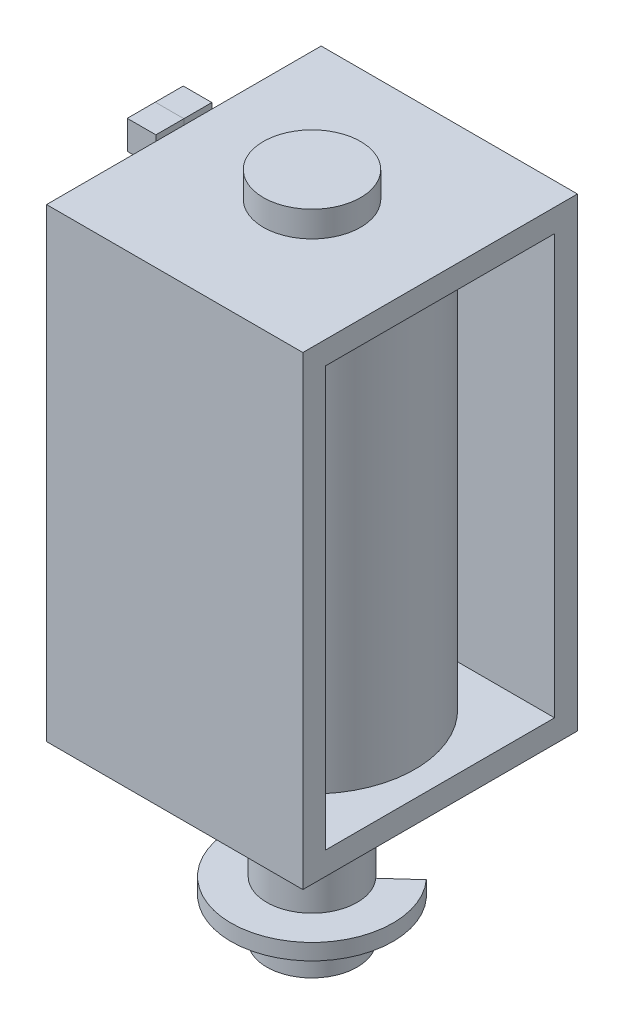
ISO-10303-21;
HEADER;
FILE_DESCRIPTION(('STEP AP214'),'2;1');
FILE_NAME('part.step','',(''),(''),'','','');
FILE_SCHEMA(('AUTOMOTIVE_DESIGN { 1 0 10303 214 1 1 1 1 }'));
ENDSEC;
DATA;
#1=APPLICATION_CONTEXT('core data for automotive mechanical design processes');
#2=APPLICATION_PROTOCOL_DEFINITION('international standard','automotive_design',2000,#1);
#3=PRODUCT_CONTEXT('',#1,'mechanical');
#4=PRODUCT('Part','Part','',(#3));
#5=PRODUCT_RELATED_PRODUCT_CATEGORY('part','',(#4));
#6=PRODUCT_DEFINITION_FORMATION('','',#4);
#7=PRODUCT_DEFINITION_CONTEXT('part definition',#1,'design');
#8=PRODUCT_DEFINITION('design','',#6,#7);
#9=PRODUCT_DEFINITION_SHAPE('','',#8);
#10=(LENGTH_UNIT() NAMED_UNIT(*) SI_UNIT(.MILLI.,.METRE.));
#11=(NAMED_UNIT(*) PLANE_ANGLE_UNIT() SI_UNIT($,.RADIAN.));
#12=(NAMED_UNIT(*) SI_UNIT($,.STERADIAN.) SOLID_ANGLE_UNIT());
#13=UNCERTAINTY_MEASURE_WITH_UNIT(LENGTH_MEASURE(1.E-05),#10,'distance_accuracy_value','');
#14=(GEOMETRIC_REPRESENTATION_CONTEXT(3) GLOBAL_UNCERTAINTY_ASSIGNED_CONTEXT((#13)) GLOBAL_UNIT_ASSIGNED_CONTEXT((#10,
#11,#12)) REPRESENTATION_CONTEXT('',''));
#15=CARTESIAN_POINT('',(0.,0.,0.));
#16=DIRECTION('',(0.,0.,1.));
#17=DIRECTION('',(1.,0.,0.));
#18=AXIS2_PLACEMENT_3D('',#15,#16,#17);
#19=CARTESIAN_POINT('',(-6.9596,0.,1.24287012850082));
#20=DIRECTION('',(0.,0.,1.));
#21=DIRECTION('',(1.,0.,0.));
#22=AXIS2_PLACEMENT_3D('',#19,#20,#21);
#23=PLANE('',#22);
#24=DIRECTION('',(0.,-1.,0.));
#25=VECTOR('',#24,1.);
#26=CARTESIAN_POINT('',(-5.6896,0.,1.24287012850082));
#27=LINE('',#26,#25);
#28=CARTESIAN_POINT('',(-5.6896,10.5791,1.24287012850082));
#29=VERTEX_POINT('',#28);
#30=CARTESIAN_POINT('',(-5.6896,9.3091,1.24287012850082));
#31=VERTEX_POINT('',#30);
#32=EDGE_CURVE('E115',#29,#31,#27,.T.);
#33=ORIENTED_EDGE('',*,*,#32,.F.);
#34=DIRECTION('',(1.,0.,0.));
#35=VECTOR('',#34,1.);
#36=CARTESIAN_POINT('',(-6.9596,10.5791,1.24287012850082));
#37=LINE('',#36,#35);
#38=CARTESIAN_POINT('',(-6.9596,10.5791,1.24287012850082));
#39=VERTEX_POINT('',#38);
#40=EDGE_CURVE('E12',#39,#29,#37,.T.);
#41=ORIENTED_EDGE('',*,*,#40,.F.);
#42=DIRECTION('',(0.,-1.,0.));
#43=VECTOR('',#42,1.);
#44=CARTESIAN_POINT('',(-6.9596,0.,1.24287012850082));
#45=LINE('',#44,#43);
#46=CARTESIAN_POINT('',(-6.9596,9.3091,1.24287012850082));
#47=VERTEX_POINT('',#46);
#48=EDGE_CURVE('E108',#39,#47,#45,.T.);
#49=ORIENTED_EDGE('',*,*,#48,.T.);
#50=DIRECTION('',(1.,0.,0.));
#51=VECTOR('',#50,1.);
#52=CARTESIAN_POINT('',(-6.9596,9.3091,1.24287012850082));
#53=LINE('',#52,#51);
#54=EDGE_CURVE('E90',#47,#31,#53,.T.);
#55=ORIENTED_EDGE('',*,*,#54,.T.);
#56=EDGE_LOOP('',(#33,#41,#49,#55));
#57=FACE_BOUND('',#56,.T.);
#58=ADVANCED_FACE('F52',(#57),#23,.T.);
#59=CARTESIAN_POINT('',(-6.9596,10.5791,0.));
#60=DIRECTION('',(0.,1.,0.));
#61=DIRECTION('',(0.,0.,1.));
#62=AXIS2_PLACEMENT_3D('',#59,#60,#61);
#63=PLANE('',#62);
#64=DIRECTION('',(0.,0.,1.));
#65=VECTOR('',#64,1.);
#66=CARTESIAN_POINT('',(-5.6896,10.5791,0.));
#67=LINE('',#66,#65);
#68=CARTESIAN_POINT('',(-5.6896,10.5791,0.));
#69=VERTEX_POINT('',#68);
#70=EDGE_CURVE('E101',#69,#29,#67,.T.);
#71=ORIENTED_EDGE('',*,*,#70,.F.);
#72=DIRECTION('',(1.,0.,0.));
#73=VECTOR('',#72,1.);
#74=CARTESIAN_POINT('',(-6.9596,10.5791,0.));
#75=LINE('',#74,#73);
#76=CARTESIAN_POINT('',(-6.9596,10.5791,0.));
#77=VERTEX_POINT('',#76);
#78=EDGE_CURVE('E60',#77,#69,#75,.T.);
#79=ORIENTED_EDGE('',*,*,#78,.F.);
#80=DIRECTION('',(0.,0.,1.));
#81=VECTOR('',#80,1.);
#82=CARTESIAN_POINT('',(-6.9596,10.5791,0.));
#83=LINE('',#82,#81);
#84=EDGE_CURVE('E99',#77,#39,#83,.T.);
#85=ORIENTED_EDGE('',*,*,#84,.T.);
#86=ORIENTED_EDGE('',*,*,#40,.T.);
#87=EDGE_LOOP('',(#71,#79,#85,#86));
#88=FACE_BOUND('',#87,.T.);
#89=ADVANCED_FACE('F98',(#88),#63,.T.);
#90=CARTESIAN_POINT('',(-6.9596,0.,0.));
#91=DIRECTION('',(0.,0.,-1.));
#92=DIRECTION('',(-1.,0.,0.));
#93=AXIS2_PLACEMENT_3D('',#90,#91,#92);
#94=PLANE('',#93);
#95=DIRECTION('',(0.,1.,0.));
#96=VECTOR('',#95,1.);
#97=CARTESIAN_POINT('',(-5.6896,0.,0.));
#98=LINE('',#97,#96);
#99=CARTESIAN_POINT('',(-5.6896,9.3091,0.));
#100=VERTEX_POINT('',#99);
#101=EDGE_CURVE('E119',#100,#69,#98,.T.);
#102=ORIENTED_EDGE('',*,*,#101,.F.);
#103=DIRECTION('',(1.,0.,0.));
#104=VECTOR('',#103,1.);
#105=CARTESIAN_POINT('',(-6.9596,9.3091,0.));
#106=LINE('',#105,#104);
#107=CARTESIAN_POINT('',(-6.9596,9.3091,0.));
#108=VERTEX_POINT('',#107);
#109=EDGE_CURVE('E83',#108,#100,#106,.T.);
#110=ORIENTED_EDGE('',*,*,#109,.F.);
#111=DIRECTION('',(0.,1.,0.));
#112=VECTOR('',#111,1.);
#113=CARTESIAN_POINT('',(-6.9596,0.,0.));
#114=LINE('',#113,#112);
#115=EDGE_CURVE('E107',#108,#77,#114,.T.);
#116=ORIENTED_EDGE('',*,*,#115,.T.);
#117=ORIENTED_EDGE('',*,*,#78,.T.);
#118=EDGE_LOOP('',(#102,#110,#116,#117));
#119=FACE_BOUND('',#118,.T.);
#120=ADVANCED_FACE('F110',(#119),#94,.T.);
#121=CARTESIAN_POINT('',(-6.9596,9.3091,0.));
#122=DIRECTION('',(0.,1.,0.));
#123=DIRECTION('',(0.,0.,1.));
#124=AXIS2_PLACEMENT_3D('',#121,#122,#123);
#125=PLANE('',#124);
#126=DIRECTION('',(0.,0.,1.));
#127=VECTOR('',#126,1.);
#128=CARTESIAN_POINT('',(-5.6896,9.3091,0.));
#129=LINE('',#128,#127);
#130=EDGE_CURVE('E121',#100,#31,#129,.T.);
#131=ORIENTED_EDGE('',*,*,#130,.T.);
#132=ORIENTED_EDGE('',*,*,#54,.F.);
#133=DIRECTION('',(0.,0.,1.));
#134=VECTOR('',#133,1.);
#135=CARTESIAN_POINT('',(-6.9596,9.3091,0.));
#136=LINE('',#135,#134);
#137=EDGE_CURVE('E68',#108,#47,#136,.T.);
#138=ORIENTED_EDGE('',*,*,#137,.F.);
#139=ORIENTED_EDGE('',*,*,#109,.T.);
#140=EDGE_LOOP('',(#131,#132,#138,#139));
#141=FACE_BOUND('',#140,.T.);
#142=ADVANCED_FACE('F131',(#141),#125,.F.);
#143=CARTESIAN_POINT('',(-6.9596,0.,0.));
#144=DIRECTION('',(-1.,0.,0.));
#145=DIRECTION('',(0.,0.,1.));
#146=AXIS2_PLACEMENT_3D('',#143,#144,#145);
#147=PLANE('',#146);
#148=ORIENTED_EDGE('',*,*,#48,.F.);
#149=ORIENTED_EDGE('',*,*,#84,.F.);
#150=ORIENTED_EDGE('',*,*,#115,.F.);
#151=ORIENTED_EDGE('',*,*,#137,.T.);
#152=EDGE_LOOP('',(#148,#149,#150,#151));
#153=FACE_BOUND('',#152,.T.);
#154=ADVANCED_FACE('F106',(#153),#147,.T.);
#155=CARTESIAN_POINT('',(-5.6896,0.,0.));
#156=DIRECTION('',(-1.,0.,0.));
#157=DIRECTION('',(0.,0.,1.));
#158=AXIS2_PLACEMENT_3D('',#155,#156,#157);
#159=PLANE('',#158);
#160=ORIENTED_EDGE('',*,*,#32,.T.);
#161=ORIENTED_EDGE('',*,*,#130,.F.);
#162=ORIENTED_EDGE('',*,*,#101,.T.);
#163=ORIENTED_EDGE('',*,*,#70,.T.);
#164=EDGE_LOOP('',(#160,#161,#162,#163));
#165=FACE_BOUND('',#164,.T.);
#166=ADVANCED_FACE('F136',(#165),#159,.F.);
#167=CLOSED_SHELL('',(#58,#89,#120,#142,#154,#166));
#168=MANIFOLD_SOLID_BREP('B2',#167);
#169=CARTESIAN_POINT('',(-6.9596,0.,0.));
#170=DIRECTION('',(0.,0.,-1.));
#171=DIRECTION('',(-1.,0.,0.));
#172=AXIS2_PLACEMENT_3D('',#169,#170,#171);
#173=PLANE('',#172);
#174=DIRECTION('',(0.,1.,0.));
#175=VECTOR('',#174,1.);
#176=CARTESIAN_POINT('',(-5.6896,0.,0.));
#177=LINE('',#176,#175);
#178=CARTESIAN_POINT('',(-5.6896,9.3091,0.));
#179=VERTEX_POINT('',#178);
#180=CARTESIAN_POINT('',(-5.6896,10.5791,0.));
#181=VERTEX_POINT('',#180);
#182=EDGE_CURVE('E259',#179,#181,#177,.T.);
#183=ORIENTED_EDGE('',*,*,#182,.T.);
#184=DIRECTION('',(1.,0.,0.));
#185=VECTOR('',#184,1.);
#186=CARTESIAN_POINT('',(-6.9596,10.5791,0.));
#187=LINE('',#186,#185);
#188=CARTESIAN_POINT('',(-6.9596,10.5791,0.));
#189=VERTEX_POINT('',#188);
#190=EDGE_CURVE('E50',#189,#181,#187,.T.);
#191=ORIENTED_EDGE('',*,*,#190,.F.);
#192=DIRECTION('',(0.,1.,0.));
#193=VECTOR('',#192,1.);
#194=CARTESIAN_POINT('',(-6.9596,0.,0.));
#195=LINE('',#194,#193);
#196=CARTESIAN_POINT('',(-6.9596,9.3091,0.));
#197=VERTEX_POINT('',#196);
#198=EDGE_CURVE('E247',#197,#189,#195,.T.);
#199=ORIENTED_EDGE('',*,*,#198,.F.);
#200=DIRECTION('',(1.,0.,0.));
#201=VECTOR('',#200,1.);
#202=CARTESIAN_POINT('',(-6.9596,9.3091,0.));
#203=LINE('',#202,#201);
#204=EDGE_CURVE('E255',#197,#179,#203,.T.);
#205=ORIENTED_EDGE('',*,*,#204,.T.);
#206=EDGE_LOOP('',(#183,#191,#199,#205));
#207=FACE_BOUND('',#206,.T.);
#208=ADVANCED_FACE('F196',(#207),#173,.F.);
#209=CARTESIAN_POINT('',(-6.9596,10.5791,0.));
#210=DIRECTION('',(0.,-1.,0.));
#211=DIRECTION('',(0.,0.,-1.));
#212=AXIS2_PLACEMENT_3D('',#209,#210,#211);
#213=PLANE('',#212);
#214=DIRECTION('',(0.,0.,-1.));
#215=VECTOR('',#214,1.);
#216=CARTESIAN_POINT('',(-5.6896,10.5791,0.));
#217=LINE('',#216,#215);
#218=CARTESIAN_POINT('',(-5.6896,10.5791,-1.24287012850082));
#219=VERTEX_POINT('',#218);
#220=EDGE_CURVE('E251',#181,#219,#217,.T.);
#221=ORIENTED_EDGE('',*,*,#220,.T.);
#222=DIRECTION('',(1.,0.,0.));
#223=VECTOR('',#222,1.);
#224=CARTESIAN_POINT('',(-6.9596,10.5791,-1.24287012850082));
#225=LINE('',#224,#223);
#226=CARTESIAN_POINT('',(-6.9596,10.5791,-1.24287012850082));
#227=VERTEX_POINT('',#226);
#228=EDGE_CURVE('E204',#227,#219,#225,.T.);
#229=ORIENTED_EDGE('',*,*,#228,.F.);
#230=DIRECTION('',(0.,0.,-1.));
#231=VECTOR('',#230,1.);
#232=CARTESIAN_POINT('',(-6.9596,10.5791,0.));
#233=LINE('',#232,#231);
#234=EDGE_CURVE('E242',#189,#227,#233,.T.);
#235=ORIENTED_EDGE('',*,*,#234,.F.);
#236=ORIENTED_EDGE('',*,*,#190,.T.);
#237=EDGE_LOOP('',(#221,#229,#235,#236));
#238=FACE_BOUND('',#237,.T.);
#239=ADVANCED_FACE('F250',(#238),#213,.F.);
#240=CARTESIAN_POINT('',(-6.9596,0.,-1.24287012850083));
#241=DIRECTION('',(0.,0.,1.));
#242=DIRECTION('',(0.,-1.,0.));
#243=AXIS2_PLACEMENT_3D('',#240,#241,#242);
#244=PLANE('',#243);
#245=DIRECTION('',(0.,-1.,0.));
#246=VECTOR('',#245,1.);
#247=CARTESIAN_POINT('',(-5.6896,0.,-1.24287012850083));
#248=LINE('',#247,#246);
#249=CARTESIAN_POINT('',(-5.6896,9.3091,-1.24287012850082));
#250=VERTEX_POINT('',#249);
#251=EDGE_CURVE('E229',#219,#250,#248,.T.);
#252=ORIENTED_EDGE('',*,*,#251,.T.);
#253=DIRECTION('',(1.,0.,0.));
#254=VECTOR('',#253,1.);
#255=CARTESIAN_POINT('',(-6.9596,9.3091,-1.24287012850082));
#256=LINE('',#255,#254);
#257=CARTESIAN_POINT('',(-6.9596,9.3091,-1.24287012850082));
#258=VERTEX_POINT('',#257);
#259=EDGE_CURVE('E252',#258,#250,#256,.T.);
#260=ORIENTED_EDGE('',*,*,#259,.F.);
#261=DIRECTION('',(0.,-1.,0.));
#262=VECTOR('',#261,1.);
#263=CARTESIAN_POINT('',(-6.9596,0.,-1.24287012850083));
#264=LINE('',#263,#262);
#265=EDGE_CURVE('E245',#227,#258,#264,.T.);
#266=ORIENTED_EDGE('',*,*,#265,.F.);
#267=ORIENTED_EDGE('',*,*,#228,.T.);
#268=EDGE_LOOP('',(#252,#260,#266,#267));
#269=FACE_BOUND('',#268,.T.);
#270=ADVANCED_FACE('F253',(#269),#244,.F.);
#271=CARTESIAN_POINT('',(-6.9596,9.3091,0.));
#272=DIRECTION('',(0.,1.,0.));
#273=DIRECTION('',(0.,0.,1.));
#274=AXIS2_PLACEMENT_3D('',#271,#272,#273);
#275=PLANE('',#274);
#276=DIRECTION('',(0.,0.,1.));
#277=VECTOR('',#276,1.);
#278=CARTESIAN_POINT('',(-5.6896,9.3091,0.));
#279=LINE('',#278,#277);
#280=EDGE_CURVE('E235',#250,#179,#279,.T.);
#281=ORIENTED_EDGE('',*,*,#280,.T.);
#282=ORIENTED_EDGE('',*,*,#204,.F.);
#283=DIRECTION('',(0.,0.,1.));
#284=VECTOR('',#283,1.);
#285=CARTESIAN_POINT('',(-6.9596,9.3091,0.));
#286=LINE('',#285,#284);
#287=EDGE_CURVE('E212',#258,#197,#286,.T.);
#288=ORIENTED_EDGE('',*,*,#287,.F.);
#289=ORIENTED_EDGE('',*,*,#259,.T.);
#290=EDGE_LOOP('',(#281,#282,#288,#289));
#291=FACE_BOUND('',#290,.T.);
#292=ADVANCED_FACE('F266',(#291),#275,.F.);
#293=CARTESIAN_POINT('',(-6.9596,0.,0.));
#294=DIRECTION('',(-1.,0.,0.));
#295=DIRECTION('',(0.,0.,1.));
#296=AXIS2_PLACEMENT_3D('',#293,#294,#295);
#297=PLANE('',#296);
#298=ORIENTED_EDGE('',*,*,#198,.T.);
#299=ORIENTED_EDGE('',*,*,#234,.T.);
#300=ORIENTED_EDGE('',*,*,#265,.T.);
#301=ORIENTED_EDGE('',*,*,#287,.T.);
#302=EDGE_LOOP('',(#298,#299,#300,#301));
#303=FACE_BOUND('',#302,.T.);
#304=ADVANCED_FACE('F243',(#303),#297,.T.);
#305=CARTESIAN_POINT('',(-5.6896,0.,0.));
#306=DIRECTION('',(-1.,0.,0.));
#307=DIRECTION('',(0.,0.,1.));
#308=AXIS2_PLACEMENT_3D('',#305,#306,#307);
#309=PLANE('',#308);
#310=ORIENTED_EDGE('',*,*,#182,.F.);
#311=ORIENTED_EDGE('',*,*,#280,.F.);
#312=ORIENTED_EDGE('',*,*,#251,.F.);
#313=ORIENTED_EDGE('',*,*,#220,.F.);
#314=EDGE_LOOP('',(#310,#311,#312,#313));
#315=FACE_BOUND('',#314,.T.);
#316=ADVANCED_FACE('F269',(#315),#309,.F.);
#317=CLOSED_SHELL('',(#208,#239,#270,#292,#304,#316));
#318=MANIFOLD_SOLID_BREP('B6',#317);
#319=CARTESIAN_POINT('',(0.,11.4681,0.));
#320=DIRECTION('',(0.,-1.,0.));
#321=DIRECTION('',(0.,0.,-1.));
#322=AXIS2_PLACEMENT_3D('',#319,#320,#321);
#323=CYLINDRICAL_SURFACE('',#322,2.159);
#324=CARTESIAN_POINT('',(0.,11.4681,0.));
#325=DIRECTION('',(0.,1.,0.));
#326=DIRECTION('',(0.,0.,1.));
#327=AXIS2_PLACEMENT_3D('',#324,#325,#326);
#328=CIRCLE('',#327,2.159);
#329=CARTESIAN_POINT('',(0.,11.4681,2.159));
#330=VERTEX_POINT('',#329);
#331=EDGE_CURVE('E195',#330,#330,#328,.T.);
#332=ORIENTED_EDGE('',*,*,#331,.F.);
#333=EDGE_LOOP('',(#332));
#334=FACE_BOUND('',#333,.T.);
#335=CARTESIAN_POINT('',(0.,10.3251,0.));
#336=DIRECTION('',(0.,1.,0.));
#337=DIRECTION('',(0.,0.,1.));
#338=AXIS2_PLACEMENT_3D('',#335,#336,#337);
#339=CIRCLE('',#338,2.159);
#340=CARTESIAN_POINT('',(0.,10.3251,2.159));
#341=VERTEX_POINT('',#340);
#342=EDGE_CURVE('E343',#341,#341,#339,.T.);
#343=ORIENTED_EDGE('',*,*,#342,.T.);
#344=EDGE_LOOP('',(#343));
#345=FACE_BOUND('',#344,.T.);
#346=ADVANCED_FACE('F340',(#334,#345),#323,.T.);
#347=CARTESIAN_POINT('',(0.,11.4681,0.));
#348=DIRECTION('',(0.,1.,0.));
#349=DIRECTION('',(0.,0.,1.));
#350=AXIS2_PLACEMENT_3D('',#347,#348,#349);
#351=PLANE('',#350);
#352=ORIENTED_EDGE('',*,*,#331,.T.);
#353=EDGE_LOOP('',(#352));
#354=FACE_BOUND('',#353,.T.);
#355=ADVANCED_FACE('F355',(#354),#351,.T.);
#356=CARTESIAN_POINT('',(0.,10.3251,0.));
#357=DIRECTION('',(0.,1.,0.));
#358=DIRECTION('',(0.,0.,1.));
#359=AXIS2_PLACEMENT_3D('',#356,#357,#358);
#360=PLANE('',#359);
#361=ORIENTED_EDGE('',*,*,#342,.F.);
#362=EDGE_LOOP('',(#361));
#363=FACE_BOUND('',#362,.T.);
#364=ADVANCED_FACE('F353',(#363),#360,.F.);
#365=CLOSED_SHELL('',(#346,#355,#364));
#366=MANIFOLD_SOLID_BREP('B44',#365);
#367=CARTESIAN_POINT('',(5.6896,0.,0.));
#368=DIRECTION('',(1.,0.,0.));
#369=DIRECTION('',(0.,0.,-1.));
#370=AXIS2_PLACEMENT_3D('',#367,#368,#369);
#371=PLANE('',#370);
#372=DIRECTION('',(0.,-1.,0.));
#373=VECTOR('',#372,1.);
#374=CARTESIAN_POINT('',(5.6896,-10.3251,6.096));
#375=LINE('',#374,#373);
#376=CARTESIAN_POINT('',(5.6896,10.3251,6.096));
#377=VERTEX_POINT('',#376);
#378=CARTESIAN_POINT('',(5.6896,-10.3251,6.096));
#379=VERTEX_POINT('',#378);
#380=EDGE_CURVE('E534',#377,#379,#375,.T.);
#381=ORIENTED_EDGE('',*,*,#380,.T.);
#382=DIRECTION('',(0.,0.,-1.));
#383=VECTOR('',#382,1.);
#384=CARTESIAN_POINT('',(5.6896,-10.3251,-6.096));
#385=LINE('',#384,#383);
#386=CARTESIAN_POINT('',(5.6896,-10.3251,-6.096));
#387=VERTEX_POINT('',#386);
#388=EDGE_CURVE('E537',#379,#387,#385,.T.);
#389=ORIENTED_EDGE('',*,*,#388,.T.);
#390=DIRECTION('',(0.,1.,0.));
#391=VECTOR('',#390,1.);
#392=CARTESIAN_POINT('',(5.6896,-10.3251,-6.096));
#393=LINE('',#392,#391);
#394=CARTESIAN_POINT('',(5.6896,10.3251,-6.096));
#395=VERTEX_POINT('',#394);
#396=EDGE_CURVE('E540',#387,#395,#393,.T.);
#397=ORIENTED_EDGE('',*,*,#396,.T.);
#398=DIRECTION('',(0.,0.,1.));
#399=VECTOR('',#398,1.);
#400=CARTESIAN_POINT('',(5.6896,10.3251,-6.096));
#401=LINE('',#400,#399);
#402=EDGE_CURVE('E542',#395,#377,#401,.T.);
#403=ORIENTED_EDGE('',*,*,#402,.T.);
#404=EDGE_LOOP('',(#381,#389,#397,#403));
#405=FACE_BOUND('',#404,.T.);
#406=DIRECTION('',(0.,0.,-1.));
#407=VECTOR('',#406,1.);
#408=CARTESIAN_POINT('',(5.6896,-9.3091,-5.08));
#409=LINE('',#408,#407);
#410=CARTESIAN_POINT('',(5.6896,-9.3091,5.08));
#411=VERTEX_POINT('',#410);
#412=CARTESIAN_POINT('',(5.6896,-9.3091,-5.08));
#413=VERTEX_POINT('',#412);
#414=EDGE_CURVE('E505',#411,#413,#409,.T.);
#415=ORIENTED_EDGE('',*,*,#414,.F.);
#416=DIRECTION('',(0.,-1.,0.));
#417=VECTOR('',#416,1.);
#418=CARTESIAN_POINT('',(5.6896,-9.3091,5.08));
#419=LINE('',#418,#417);
#420=CARTESIAN_POINT('',(5.6896,9.3091,5.08));
#421=VERTEX_POINT('',#420);
#422=EDGE_CURVE('E503',#421,#411,#419,.T.);
#423=ORIENTED_EDGE('',*,*,#422,.F.);
#424=DIRECTION('',(0.,0.,1.));
#425=VECTOR('',#424,1.);
#426=CARTESIAN_POINT('',(5.6896,9.3091,-5.08));
#427=LINE('',#426,#425);
#428=CARTESIAN_POINT('',(5.6896,9.3091,-5.08));
#429=VERTEX_POINT('',#428);
#430=EDGE_CURVE('E511',#429,#421,#427,.T.);
#431=ORIENTED_EDGE('',*,*,#430,.F.);
#432=DIRECTION('',(0.,1.,0.));
#433=VECTOR('',#432,1.);
#434=CARTESIAN_POINT('',(5.6896,-9.3091,-5.08));
#435=LINE('',#434,#433);
#436=EDGE_CURVE('E508',#413,#429,#435,.T.);
#437=ORIENTED_EDGE('',*,*,#436,.F.);
#438=EDGE_LOOP('',(#415,#423,#431,#437));
#439=FACE_BOUND('',#438,.T.);
#440=ADVANCED_FACE('F380',(#405,#439),#371,.T.);
#441=CARTESIAN_POINT('',(-5.6896,0.,0.));
#442=DIRECTION('',(1.,0.,0.));
#443=DIRECTION('',(0.,0.,-1.));
#444=AXIS2_PLACEMENT_3D('',#441,#442,#443);
#445=PLANE('',#444);
#446=DIRECTION('',(0.,-1.,0.));
#447=VECTOR('',#446,1.);
#448=CARTESIAN_POINT('',(-5.6896,-10.3251,6.096));
#449=LINE('',#448,#447);
#450=CARTESIAN_POINT('',(-5.6896,10.3251,6.096));
#451=VERTEX_POINT('',#450);
#452=CARTESIAN_POINT('',(-5.6896,-10.3251,6.096));
#453=VERTEX_POINT('',#452);
#454=EDGE_CURVE('E533',#451,#453,#449,.T.);
#455=ORIENTED_EDGE('',*,*,#454,.F.);
#456=DIRECTION('',(0.,0.,1.));
#457=VECTOR('',#456,1.);
#458=CARTESIAN_POINT('',(-5.6896,10.3251,-6.096));
#459=LINE('',#458,#457);
#460=CARTESIAN_POINT('',(-5.6896,10.3251,-6.096));
#461=VERTEX_POINT('',#460);
#462=EDGE_CURVE('E538',#461,#451,#459,.T.);
#463=ORIENTED_EDGE('',*,*,#462,.F.);
#464=DIRECTION('',(0.,1.,0.));
#465=VECTOR('',#464,1.);
#466=CARTESIAN_POINT('',(-5.6896,-10.3251,-6.096));
#467=LINE('',#466,#465);
#468=CARTESIAN_POINT('',(-5.6896,-10.3251,-6.096));
#469=VERTEX_POINT('',#468);
#470=EDGE_CURVE('E549',#469,#461,#467,.T.);
#471=ORIENTED_EDGE('',*,*,#470,.F.);
#472=DIRECTION('',(0.,0.,-1.));
#473=VECTOR('',#472,1.);
#474=CARTESIAN_POINT('',(-5.6896,-10.3251,-6.096));
#475=LINE('',#474,#473);
#476=EDGE_CURVE('E547',#453,#469,#475,.T.);
#477=ORIENTED_EDGE('',*,*,#476,.F.);
#478=EDGE_LOOP('',(#455,#463,#471,#477));
#479=FACE_BOUND('',#478,.T.);
#480=DIRECTION('',(0.,-1.,0.));
#481=VECTOR('',#480,1.);
#482=CARTESIAN_POINT('',(-5.6896,-9.3091,5.08));
#483=LINE('',#482,#481);
#484=CARTESIAN_POINT('',(-5.6896,9.3091,5.08));
#485=VERTEX_POINT('',#484);
#486=CARTESIAN_POINT('',(-5.6896,-9.3091,5.08));
#487=VERTEX_POINT('',#486);
#488=EDGE_CURVE('E502',#485,#487,#483,.T.);
#489=ORIENTED_EDGE('',*,*,#488,.T.);
#490=DIRECTION('',(0.,0.,-1.));
#491=VECTOR('',#490,1.);
#492=CARTESIAN_POINT('',(-5.6896,-9.3091,-5.08));
#493=LINE('',#492,#491);
#494=CARTESIAN_POINT('',(-5.6896,-9.3091,-5.08));
#495=VERTEX_POINT('',#494);
#496=EDGE_CURVE('E516',#487,#495,#493,.T.);
#497=ORIENTED_EDGE('',*,*,#496,.T.);
#498=DIRECTION('',(0.,1.,0.));
#499=VECTOR('',#498,1.);
#500=CARTESIAN_POINT('',(-5.6896,-9.3091,-5.08));
#501=LINE('',#500,#499);
#502=CARTESIAN_POINT('',(-5.6896,9.3091,-5.08));
#503=VERTEX_POINT('',#502);
#504=EDGE_CURVE('E519',#495,#503,#501,.T.);
#505=ORIENTED_EDGE('',*,*,#504,.T.);
#506=DIRECTION('',(0.,0.,1.));
#507=VECTOR('',#506,1.);
#508=CARTESIAN_POINT('',(-5.6896,9.3091,-5.08));
#509=LINE('',#508,#507);
#510=EDGE_CURVE('E506',#503,#485,#509,.T.);
#511=ORIENTED_EDGE('',*,*,#510,.T.);
#512=EDGE_LOOP('',(#489,#497,#505,#511));
#513=FACE_BOUND('',#512,.T.);
#514=ADVANCED_FACE('F570',(#479,#513),#445,.F.);
#515=CARTESIAN_POINT('',(5.6896,-10.3251,6.096));
#516=DIRECTION('',(0.,0.,-1.));
#517=DIRECTION('',(-1.,0.,0.));
#518=AXIS2_PLACEMENT_3D('',#515,#516,#517);
#519=PLANE('',#518);
#520=ORIENTED_EDGE('',*,*,#454,.T.);
#521=DIRECTION('',(-1.,0.,0.));
#522=VECTOR('',#521,1.);
#523=CARTESIAN_POINT('',(5.6896,-10.3251,6.096));
#524=LINE('',#523,#522);
#525=EDGE_CURVE('E389',#379,#453,#524,.T.);
#526=ORIENTED_EDGE('',*,*,#525,.F.);
#527=ORIENTED_EDGE('',*,*,#380,.F.);
#528=DIRECTION('',(-1.,0.,0.));
#529=VECTOR('',#528,1.);
#530=CARTESIAN_POINT('',(5.6896,10.3251,6.096));
#531=LINE('',#530,#529);
#532=EDGE_CURVE('E544',#377,#451,#531,.T.);
#533=ORIENTED_EDGE('',*,*,#532,.T.);
#534=EDGE_LOOP('',(#520,#526,#527,#533));
#535=FACE_BOUND('',#534,.T.);
#536=ADVANCED_FACE('F382',(#535),#519,.F.);
#537=CARTESIAN_POINT('',(5.6896,-10.3251,-6.096));
#538=DIRECTION('',(0.,1.,0.));
#539=DIRECTION('',(0.,0.,1.));
#540=AXIS2_PLACEMENT_3D('',#537,#538,#539);
#541=PLANE('',#540);
#542=CARTESIAN_POINT('',(0.,-10.3251,0.));
#543=DIRECTION('',(0.,-1.,0.));
#544=DIRECTION('',(0.,0.,-1.));
#545=AXIS2_PLACEMENT_3D('',#542,#543,#544);
#546=CIRCLE('',#545,2.0066);
#547=CARTESIAN_POINT('',(0.,-10.3251,-2.0066));
#548=VERTEX_POINT('',#547);
#549=EDGE_CURVE('E338',#548,#548,#546,.T.);
#550=ORIENTED_EDGE('',*,*,#549,.F.);
#551=EDGE_LOOP('',(#550));
#552=FACE_BOUND('',#551,.T.);
#553=ORIENTED_EDGE('',*,*,#476,.T.);
#554=DIRECTION('',(-1.,0.,0.));
#555=VECTOR('',#554,1.);
#556=CARTESIAN_POINT('',(5.6896,-10.3251,-6.096));
#557=LINE('',#556,#555);
#558=EDGE_CURVE('E557',#387,#469,#557,.T.);
#559=ORIENTED_EDGE('',*,*,#558,.F.);
#560=ORIENTED_EDGE('',*,*,#388,.F.);
#561=ORIENTED_EDGE('',*,*,#525,.T.);
#562=EDGE_LOOP('',(#553,#559,#560,#561));
#563=FACE_BOUND('',#562,.T.);
#564=ADVANCED_FACE('F562',(#552,#563),#541,.F.);
#565=CARTESIAN_POINT('',(5.6896,-10.3251,-6.096));
#566=DIRECTION('',(0.,0.,1.));
#567=DIRECTION('',(1.,0.,0.));
#568=AXIS2_PLACEMENT_3D('',#565,#566,#567);
#569=PLANE('',#568);
#570=ORIENTED_EDGE('',*,*,#470,.T.);
#571=DIRECTION('',(-1.,0.,0.));
#572=VECTOR('',#571,1.);
#573=CARTESIAN_POINT('',(5.6896,10.3251,-6.096));
#574=LINE('',#573,#572);
#575=EDGE_CURVE('E554',#395,#461,#574,.T.);
#576=ORIENTED_EDGE('',*,*,#575,.F.);
#577=ORIENTED_EDGE('',*,*,#396,.F.);
#578=ORIENTED_EDGE('',*,*,#558,.T.);
#579=EDGE_LOOP('',(#570,#576,#577,#578));
#580=FACE_BOUND('',#579,.T.);
#581=ADVANCED_FACE('F575',(#580),#569,.F.);
#582=CARTESIAN_POINT('',(5.6896,10.3251,-6.096));
#583=DIRECTION('',(0.,-1.,0.));
#584=DIRECTION('',(0.,0.,-1.));
#585=AXIS2_PLACEMENT_3D('',#582,#583,#584);
#586=PLANE('',#585);
#587=ORIENTED_EDGE('',*,*,#462,.T.);
#588=ORIENTED_EDGE('',*,*,#532,.F.);
#589=ORIENTED_EDGE('',*,*,#402,.F.);
#590=ORIENTED_EDGE('',*,*,#575,.T.);
#591=EDGE_LOOP('',(#587,#588,#589,#590));
#592=FACE_BOUND('',#591,.T.);
#593=ADVANCED_FACE('F579',(#592),#586,.F.);
#594=CARTESIAN_POINT('',(5.6896,-9.3091,5.08));
#595=DIRECTION('',(0.,0.,-1.));
#596=DIRECTION('',(-1.,0.,0.));
#597=AXIS2_PLACEMENT_3D('',#594,#595,#596);
#598=PLANE('',#597);
#599=ORIENTED_EDGE('',*,*,#488,.F.);
#600=DIRECTION('',(-1.,0.,0.));
#601=VECTOR('',#600,1.);
#602=CARTESIAN_POINT('',(5.6896,9.3091,5.08));
#603=LINE('',#602,#601);
#604=EDGE_CURVE('E513',#421,#485,#603,.T.);
#605=ORIENTED_EDGE('',*,*,#604,.F.);
#606=ORIENTED_EDGE('',*,*,#422,.T.);
#607=DIRECTION('',(-1.,0.,0.));
#608=VECTOR('',#607,1.);
#609=CARTESIAN_POINT('',(5.6896,-9.3091,5.08));
#610=LINE('',#609,#608);
#611=EDGE_CURVE('E530',#411,#487,#610,.T.);
#612=ORIENTED_EDGE('',*,*,#611,.T.);
#613=EDGE_LOOP('',(#599,#605,#606,#612));
#614=FACE_BOUND('',#613,.T.);
#615=ADVANCED_FACE('F597',(#614),#598,.T.);
#616=CARTESIAN_POINT('',(5.6896,-9.3091,-5.08));
#617=DIRECTION('',(0.,1.,0.));
#618=DIRECTION('',(0.,0.,1.));
#619=AXIS2_PLACEMENT_3D('',#616,#617,#618);
#620=PLANE('',#619);
#621=CARTESIAN_POINT('',(0.,-9.3091,0.));
#622=DIRECTION('',(0.,1.,0.));
#623=DIRECTION('',(0.,0.,1.));
#624=AXIS2_PLACEMENT_3D('',#621,#622,#623);
#625=CIRCLE('',#624,4.572);
#626=CARTESIAN_POINT('',(0.,-9.3091,4.572));
#627=VERTEX_POINT('',#626);
#628=EDGE_CURVE('E499',#627,#627,#625,.F.);
#629=ORIENTED_EDGE('',*,*,#628,.T.);
#630=EDGE_LOOP('',(#629));
#631=FACE_BOUND('',#630,.T.);
#632=ORIENTED_EDGE('',*,*,#496,.F.);
#633=ORIENTED_EDGE('',*,*,#611,.F.);
#634=ORIENTED_EDGE('',*,*,#414,.T.);
#635=DIRECTION('',(-1.,0.,0.));
#636=VECTOR('',#635,1.);
#637=CARTESIAN_POINT('',(5.6896,-9.3091,-5.08));
#638=LINE('',#637,#636);
#639=EDGE_CURVE('E528',#413,#495,#638,.T.);
#640=ORIENTED_EDGE('',*,*,#639,.T.);
#641=EDGE_LOOP('',(#632,#633,#634,#640));
#642=FACE_BOUND('',#641,.T.);
#643=ADVANCED_FACE('F591',(#631,#642),#620,.T.);
#644=CARTESIAN_POINT('',(5.6896,-9.3091,-5.08));
#645=DIRECTION('',(0.,0.,1.));
#646=DIRECTION('',(1.,0.,0.));
#647=AXIS2_PLACEMENT_3D('',#644,#645,#646);
#648=PLANE('',#647);
#649=ORIENTED_EDGE('',*,*,#504,.F.);
#650=ORIENTED_EDGE('',*,*,#639,.F.);
#651=ORIENTED_EDGE('',*,*,#436,.T.);
#652=DIRECTION('',(-1.,0.,0.));
#653=VECTOR('',#652,1.);
#654=CARTESIAN_POINT('',(5.6896,9.3091,-5.08));
#655=LINE('',#654,#653);
#656=EDGE_CURVE('E526',#429,#503,#655,.T.);
#657=ORIENTED_EDGE('',*,*,#656,.T.);
#658=EDGE_LOOP('',(#649,#650,#651,#657));
#659=FACE_BOUND('',#658,.T.);
#660=ADVANCED_FACE('F594',(#659),#648,.T.);
#661=CARTESIAN_POINT('',(5.6896,9.3091,-5.08));
#662=DIRECTION('',(0.,-1.,0.));
#663=DIRECTION('',(0.,0.,-1.));
#664=AXIS2_PLACEMENT_3D('',#661,#662,#663);
#665=PLANE('',#664);
#666=CARTESIAN_POINT('',(0.,9.3091,0.));
#667=DIRECTION('',(0.,-1.,0.));
#668=DIRECTION('',(0.,0.,-1.));
#669=AXIS2_PLACEMENT_3D('',#666,#667,#668);
#670=CIRCLE('',#669,4.572);
#671=CARTESIAN_POINT('',(0.,9.3091,-4.572));
#672=VERTEX_POINT('',#671);
#673=EDGE_CURVE('E384',#672,#672,#670,.F.);
#674=ORIENTED_EDGE('',*,*,#673,.T.);
#675=EDGE_LOOP('',(#674));
#676=FACE_BOUND('',#675,.T.);
#677=ORIENTED_EDGE('',*,*,#510,.F.);
#678=ORIENTED_EDGE('',*,*,#656,.F.);
#679=ORIENTED_EDGE('',*,*,#430,.T.);
#680=ORIENTED_EDGE('',*,*,#604,.T.);
#681=EDGE_LOOP('',(#677,#678,#679,#680));
#682=FACE_BOUND('',#681,.T.);
#683=ADVANCED_FACE('F600',(#676,#682),#665,.T.);
#684=CARTESIAN_POINT('',(0.,9.398,0.));
#685=DIRECTION('',(0.,-1.,0.));
#686=DIRECTION('',(0.,0.,-1.));
#687=AXIS2_PLACEMENT_3D('',#684,#685,#686);
#688=CYLINDRICAL_SURFACE('',#687,4.572);
#689=ORIENTED_EDGE('',*,*,#628,.F.);
#690=EDGE_LOOP('',(#689));
#691=FACE_BOUND('',#690,.T.);
#692=ORIENTED_EDGE('',*,*,#673,.F.);
#693=EDGE_LOOP('',(#692));
#694=FACE_BOUND('',#693,.T.);
#695=ADVANCED_FACE('F602',(#691,#694),#688,.T.);
#696=CARTESIAN_POINT('',(0.,-18.1991,0.));
#697=DIRECTION('',(0.,1.,0.));
#698=DIRECTION('',(0.,0.,1.));
#699=AXIS2_PLACEMENT_3D('',#696,#697,#698);
#700=CYLINDRICAL_SURFACE('',#699,2.0066);
#701=DIRECTION('',(0.,1.,0.));
#702=VECTOR('',#701,1.);
#703=CARTESIAN_POINT('',(1.4889964664311,-16.4211,-1.34511452410407));
#704=LINE('',#703,#702);
#705=CARTESIAN_POINT('',(1.4889964664311,-16.4211,-1.34511452410407));
#706=VERTEX_POINT('',#705);
#707=CARTESIAN_POINT('',(1.4889964664311,-15.7099,-1.34511452410407));
#708=VERTEX_POINT('',#707);
#709=EDGE_CURVE('E402',#706,#708,#704,.T.);
#710=ORIENTED_EDGE('',*,*,#709,.F.);
#711=CARTESIAN_POINT('',(0.,-16.4211,0.));
#712=DIRECTION('',(0.,1.,0.));
#713=DIRECTION('',(0.,0.,-1.));
#714=AXIS2_PLACEMENT_3D('',#711,#712,#713);
#715=CIRCLE('',#714,2.0066);
#716=CARTESIAN_POINT('',(-1.4889964664311,-16.4211,-1.34511452410407));
#717=VERTEX_POINT('',#716);
#718=EDGE_CURVE('E397',#717,#706,#715,.T.);
#719=ORIENTED_EDGE('',*,*,#718,.F.);
#720=DIRECTION('',(0.,1.,0.));
#721=VECTOR('',#720,1.);
#722=CARTESIAN_POINT('',(-1.4889964664311,-16.4211,-1.34511452410407));
#723=LINE('',#722,#721);
#724=CARTESIAN_POINT('',(-1.4889964664311,-15.7099,-1.34511452410407));
#725=VERTEX_POINT('',#724);
#726=EDGE_CURVE('E476',#717,#725,#723,.T.);
#727=ORIENTED_EDGE('',*,*,#726,.T.);
#728=CARTESIAN_POINT('',(0.,-15.7099,0.));
#729=DIRECTION('',(0.,1.,0.));
#730=DIRECTION('',(0.,0.,-1.));
#731=AXIS2_PLACEMENT_3D('',#728,#729,#730);
#732=CIRCLE('',#731,2.0066);
#733=EDGE_CURVE('E761',#725,#708,#732,.T.);
#734=ORIENTED_EDGE('',*,*,#733,.T.);
#735=EDGE_LOOP('',(#710,#719,#727,#734));
#736=FACE_BOUND('',#735,.T.);
#737=CARTESIAN_POINT('',(0.,-18.1991,0.));
#738=DIRECTION('',(0.,-1.,0.));
#739=DIRECTION('',(0.,0.,-1.));
#740=AXIS2_PLACEMENT_3D('',#737,#738,#739);
#741=CIRCLE('',#740,2.0066);
#742=CARTESIAN_POINT('',(0.,-18.1991,-2.0066));
#743=VERTEX_POINT('',#742);
#744=EDGE_CURVE('E492',#743,#743,#741,.T.);
#745=ORIENTED_EDGE('',*,*,#744,.F.);
#746=EDGE_LOOP('',(#745));
#747=FACE_BOUND('',#746,.T.);
#748=ORIENTED_EDGE('',*,*,#549,.T.);
#749=EDGE_LOOP('',(#748));
#750=FACE_BOUND('',#749,.T.);
#751=ADVANCED_FACE('F609',(#736,#747,#750),#700,.T.);
#752=CARTESIAN_POINT('',(0.,-18.1991,0.));
#753=DIRECTION('',(0.,-1.,0.));
#754=DIRECTION('',(0.,0.,-1.));
#755=AXIS2_PLACEMENT_3D('',#752,#753,#754);
#756=PLANE('',#755);
#757=ORIENTED_EDGE('',*,*,#744,.T.);
#758=EDGE_LOOP('',(#757));
#759=FACE_BOUND('',#758,.T.);
#760=ADVANCED_FACE('F634',(#759),#756,.T.);
#761=CARTESIAN_POINT('',(0.,-16.4211,0.));
#762=DIRECTION('',(0.,1.,0.));
#763=DIRECTION('',(0.,0.,1.));
#764=AXIS2_PLACEMENT_3D('',#761,#762,#763);
#765=CYLINDRICAL_SURFACE('',#764,3.5941);
#766=CARTESIAN_POINT('',(0.,-15.7099,0.));
#767=DIRECTION('',(0.,-1.,0.));
#768=DIRECTION('',(0.,0.,-1.));
#769=AXIS2_PLACEMENT_3D('',#766,#767,#768);
#770=CIRCLE('',#769,3.5941);
#771=CARTESIAN_POINT('',(2.667,-15.7099,-2.40928740709779));
#772=VERTEX_POINT('',#771);
#773=CARTESIAN_POINT('',(-2.667,-15.7099,-2.40928740709779));
#774=VERTEX_POINT('',#773);
#775=EDGE_CURVE('E491',#772,#774,#770,.T.);
#776=ORIENTED_EDGE('',*,*,#775,.T.);
#777=DIRECTION('',(0.,1.,0.));
#778=VECTOR('',#777,1.);
#779=CARTESIAN_POINT('',(-2.667,-16.4211,-2.40928740709779));
#780=LINE('',#779,#778);
#781=CARTESIAN_POINT('',(-2.667,-16.4211,-2.40928740709779));
#782=VERTEX_POINT('',#781);
#783=EDGE_CURVE('E474',#782,#774,#780,.T.);
#784=ORIENTED_EDGE('',*,*,#783,.F.);
#785=CARTESIAN_POINT('',(0.,-16.4211,0.));
#786=DIRECTION('',(0.,-1.,0.));
#787=DIRECTION('',(0.,0.,-1.));
#788=AXIS2_PLACEMENT_3D('',#785,#786,#787);
#789=CIRCLE('',#788,3.5941);
#790=CARTESIAN_POINT('',(2.667,-16.4211,-2.40928740709779));
#791=VERTEX_POINT('',#790);
#792=EDGE_CURVE('E478',#791,#782,#789,.T.);
#793=ORIENTED_EDGE('',*,*,#792,.F.);
#794=DIRECTION('',(0.,1.,0.));
#795=VECTOR('',#794,1.);
#796=CARTESIAN_POINT('',(2.667,-16.4211,-2.40928740709779));
#797=LINE('',#796,#795);
#798=EDGE_CURVE('E768',#791,#772,#797,.T.);
#799=ORIENTED_EDGE('',*,*,#798,.T.);
#800=EDGE_LOOP('',(#776,#784,#793,#799));
#801=FACE_BOUND('',#800,.T.);
#802=ADVANCED_FACE('F489',(#801),#765,.T.);
#803=CARTESIAN_POINT('',(-2.667,-16.4211,-2.40928740709779));
#804=DIRECTION('',(-0.670345123145653,0.,0.742049469964664));
#805=DIRECTION('',(0.742049469964664,0.,0.670345123145653));
#806=AXIS2_PLACEMENT_3D('',#803,#804,#805);
#807=PLANE('',#806);
#808=DIRECTION('',(0.742049469964664,0.,0.670345123145653));
#809=VECTOR('',#808,1.);
#810=CARTESIAN_POINT('',(-2.667,-15.7099,-2.40928740709779));
#811=LINE('',#810,#809);
#812=EDGE_CURVE('E759',#774,#725,#811,.T.);
#813=ORIENTED_EDGE('',*,*,#812,.T.);
#814=ORIENTED_EDGE('',*,*,#726,.F.);
#815=DIRECTION('',(0.742049469964664,0.,0.670345123145653));
#816=VECTOR('',#815,1.);
#817=CARTESIAN_POINT('',(-2.667,-16.4211,-2.40928740709779));
#818=LINE('',#817,#816);
#819=EDGE_CURVE('E469',#782,#717,#818,.T.);
#820=ORIENTED_EDGE('',*,*,#819,.F.);
#821=ORIENTED_EDGE('',*,*,#783,.T.);
#822=EDGE_LOOP('',(#813,#814,#820,#821));
#823=FACE_BOUND('',#822,.T.);
#824=ADVANCED_FACE('F472',(#823),#807,.F.);
#825=CARTESIAN_POINT('',(1.4889964664311,-16.4211,-1.34511452410407));
#826=DIRECTION('',(0.670345123145653,0.,0.742049469964664));
#827=DIRECTION('',(0.742049469964664,0.,-0.670345123145653));
#828=AXIS2_PLACEMENT_3D('',#825,#826,#827);
#829=PLANE('',#828);
#830=DIRECTION('',(0.742049469964664,0.,-0.670345123145653));
#831=VECTOR('',#830,1.);
#832=CARTESIAN_POINT('',(1.4889964664311,-15.7099,-1.34511452410407));
#833=LINE('',#832,#831);
#834=EDGE_CURVE('E487',#708,#772,#833,.T.);
#835=ORIENTED_EDGE('',*,*,#834,.T.);
#836=ORIENTED_EDGE('',*,*,#798,.F.);
#837=DIRECTION('',(0.742049469964664,0.,-0.670345123145653));
#838=VECTOR('',#837,1.);
#839=CARTESIAN_POINT('',(1.4889964664311,-16.4211,-1.34511452410407));
#840=LINE('',#839,#838);
#841=EDGE_CURVE('E483',#706,#791,#840,.T.);
#842=ORIENTED_EDGE('',*,*,#841,.F.);
#843=ORIENTED_EDGE('',*,*,#709,.T.);
#844=EDGE_LOOP('',(#835,#836,#842,#843));
#845=FACE_BOUND('',#844,.T.);
#846=ADVANCED_FACE('F646',(#845),#829,.F.);
#847=CARTESIAN_POINT('',(0.,-16.4211,0.));
#848=DIRECTION('',(0.,-1.,0.));
#849=DIRECTION('',(0.,0.,-1.));
#850=AXIS2_PLACEMENT_3D('',#847,#848,#849);
#851=PLANE('',#850);
#852=ORIENTED_EDGE('',*,*,#792,.T.);
#853=ORIENTED_EDGE('',*,*,#819,.T.);
#854=ORIENTED_EDGE('',*,*,#718,.T.);
#855=ORIENTED_EDGE('',*,*,#841,.T.);
#856=EDGE_LOOP('',(#852,#853,#854,#855));
#857=FACE_BOUND('',#856,.T.);
#858=ADVANCED_FACE('F481',(#857),#851,.T.);
#859=CARTESIAN_POINT('',(0.,-15.7099,0.));
#860=DIRECTION('',(0.,-1.,0.));
#861=DIRECTION('',(0.,0.,-1.));
#862=AXIS2_PLACEMENT_3D('',#859,#860,#861);
#863=PLANE('',#862);
#864=ORIENTED_EDGE('',*,*,#775,.F.);
#865=ORIENTED_EDGE('',*,*,#834,.F.);
#866=ORIENTED_EDGE('',*,*,#733,.F.);
#867=ORIENTED_EDGE('',*,*,#812,.F.);
#868=EDGE_LOOP('',(#864,#865,#866,#867));
#869=FACE_BOUND('',#868,.T.);
#870=ADVANCED_FACE('F650',(#869),#863,.F.);
#871=CLOSED_SHELL('',(#440,#514,#536,#564,#581,#593,#615,#643,#660,#683,#695,#751,#760,#802,
#824,#846,#858,#870));
#872=MANIFOLD_SOLID_BREP('B190',#871);
#873=ADVANCED_BREP_SHAPE_REPRESENTATION('',(#18,#168,#318,#366,#872),#14);
#874=SHAPE_DEFINITION_REPRESENTATION(#9,#873);
ENDSEC;
END-ISO-10303-21;
